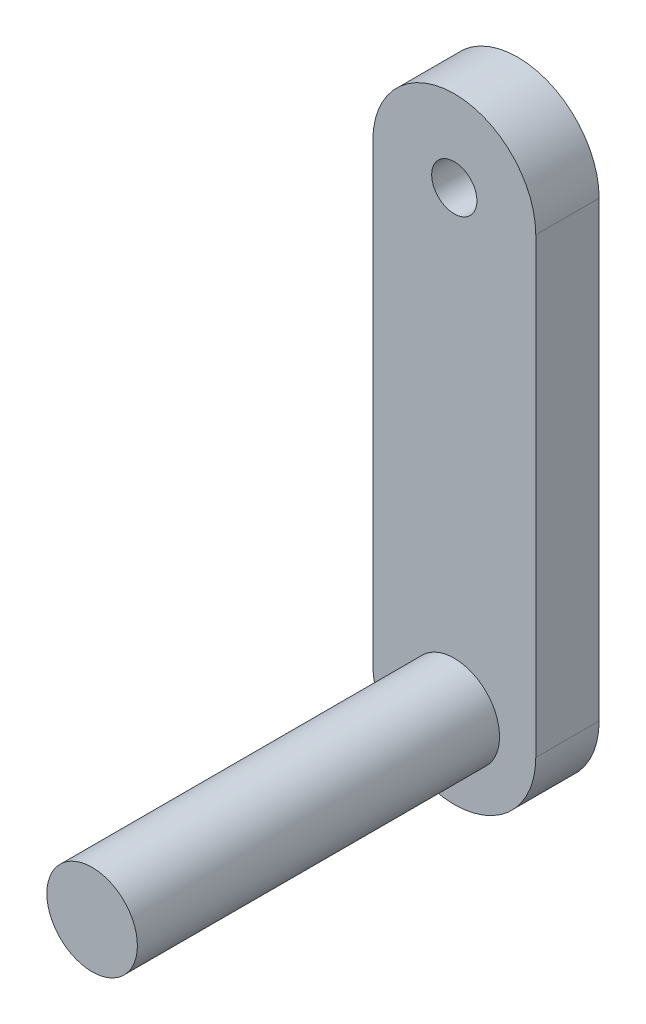
ISO-10303-21;
HEADER;
FILE_DESCRIPTION(('STEP AP214'),'2;1');
FILE_NAME('part.step','',(''),(''),'','','');
FILE_SCHEMA(('AUTOMOTIVE_DESIGN { 1 0 10303 214 1 1 1 1 }'));
ENDSEC;
DATA;
#1=APPLICATION_CONTEXT('core data for automotive mechanical design processes');
#2=APPLICATION_PROTOCOL_DEFINITION('international standard','automotive_design',2000,#1);
#3=PRODUCT_CONTEXT('',#1,'mechanical');
#4=PRODUCT('Part','Part','',(#3));
#5=PRODUCT_RELATED_PRODUCT_CATEGORY('part','',(#4));
#6=PRODUCT_DEFINITION_FORMATION('','',#4);
#7=PRODUCT_DEFINITION_CONTEXT('part definition',#1,'design');
#8=PRODUCT_DEFINITION('design','',#6,#7);
#9=PRODUCT_DEFINITION_SHAPE('','',#8);
#10=(LENGTH_UNIT() NAMED_UNIT(*) SI_UNIT(.MILLI.,.METRE.));
#11=(NAMED_UNIT(*) PLANE_ANGLE_UNIT() SI_UNIT($,.RADIAN.));
#12=(NAMED_UNIT(*) SI_UNIT($,.STERADIAN.) SOLID_ANGLE_UNIT());
#13=UNCERTAINTY_MEASURE_WITH_UNIT(LENGTH_MEASURE(1.E-05),#10,'distance_accuracy_value','');
#14=(GEOMETRIC_REPRESENTATION_CONTEXT(3) GLOBAL_UNCERTAINTY_ASSIGNED_CONTEXT((#13)) GLOBAL_UNIT_ASSIGNED_CONTEXT((#10,
#11,#12)) REPRESENTATION_CONTEXT('',''));
#15=CARTESIAN_POINT('',(0.,0.,0.));
#16=DIRECTION('',(0.,0.,1.));
#17=DIRECTION('',(1.,0.,0.));
#18=AXIS2_PLACEMENT_3D('',#15,#16,#17);
#19=CARTESIAN_POINT('',(0.,50.,7.));
#20=DIRECTION('',(0.,0.,-1.));
#21=DIRECTION('',(-1.,0.,0.));
#22=AXIS2_PLACEMENT_3D('',#19,#20,#21);
#23=PLANE('',#22);
#24=CARTESIAN_POINT('',(0.,50.,7.));
#25=DIRECTION('',(0.,0.,-1.));
#26=DIRECTION('',(-1.,0.,0.));
#27=AXIS2_PLACEMENT_3D('',#24,#25,#26);
#28=CIRCLE('',#27,2.49999999999999);
#29=CARTESIAN_POINT('',(-2.49999999999999,50.,7.));
#30=VERTEX_POINT('',#29);
#31=EDGE_CURVE('E148',#30,#30,#28,.T.);
#32=ORIENTED_EDGE('',*,*,#31,.T.);
#33=EDGE_LOOP('',(#32));
#34=FACE_BOUND('',#33,.T.);
#35=CARTESIAN_POINT('',(0.,50.,7.));
#36=DIRECTION('',(0.,0.,1.));
#37=DIRECTION('',(-1.,0.,0.));
#38=AXIS2_PLACEMENT_3D('',#35,#36,#37);
#39=CIRCLE('',#38,9.);
#40=CARTESIAN_POINT('',(9.,50.,7.));
#41=VERTEX_POINT('',#40);
#42=CARTESIAN_POINT('',(-9.,50.,7.));
#43=VERTEX_POINT('',#42);
#44=EDGE_CURVE('E88',#41,#43,#39,.T.);
#45=ORIENTED_EDGE('',*,*,#44,.T.);
#46=DIRECTION('',(0.,-1.,0.));
#47=VECTOR('',#46,1.);
#48=CARTESIAN_POINT('',(-9.,50.,7.));
#49=LINE('',#48,#47);
#50=CARTESIAN_POINT('',(-9.,0.,7.));
#51=VERTEX_POINT('',#50);
#52=EDGE_CURVE('E83',#43,#51,#49,.T.);
#53=ORIENTED_EDGE('',*,*,#52,.T.);
#54=CARTESIAN_POINT('',(0.,0.,7.));
#55=DIRECTION('',(0.,0.,1.));
#56=DIRECTION('',(1.,0.,0.));
#57=AXIS2_PLACEMENT_3D('',#54,#55,#56);
#58=CIRCLE('',#57,9.);
#59=CARTESIAN_POINT('',(9.,0.,7.));
#60=VERTEX_POINT('',#59);
#61=EDGE_CURVE('E86',#51,#60,#58,.T.);
#62=ORIENTED_EDGE('',*,*,#61,.T.);
#63=DIRECTION('',(0.,1.,0.));
#64=VECTOR('',#63,1.);
#65=CARTESIAN_POINT('',(9.,50.,7.));
#66=LINE('',#65,#64);
#67=EDGE_CURVE('E52',#60,#41,#66,.T.);
#68=ORIENTED_EDGE('',*,*,#67,.T.);
#69=EDGE_LOOP('',(#45,#53,#62,#68));
#70=FACE_BOUND('',#69,.T.);
#71=CARTESIAN_POINT('',(0.,0.,7.));
#72=DIRECTION('',(0.,0.,-1.));
#73=DIRECTION('',(-1.,0.,0.));
#74=AXIS2_PLACEMENT_3D('',#71,#72,#73);
#75=CIRCLE('',#74,5.);
#76=CARTESIAN_POINT('',(-5.,0.,7.));
#77=VERTEX_POINT('',#76);
#78=EDGE_CURVE('E11',#77,#77,#75,.F.);
#79=ORIENTED_EDGE('',*,*,#78,.F.);
#80=EDGE_LOOP('',(#79));
#81=FACE_BOUND('',#80,.T.);
#82=ADVANCED_FACE('F35',(#34,#70,#81),#23,.F.);
#83=CARTESIAN_POINT('',(0.,50.,7.));
#84=DIRECTION('',(0.,0.,-1.));
#85=DIRECTION('',(-1.,0.,0.));
#86=AXIS2_PLACEMENT_3D('',#83,#84,#85);
#87=CYLINDRICAL_SURFACE('',#86,9.);
#88=CARTESIAN_POINT('',(0.,50.,0.));
#89=DIRECTION('',(0.,0.,1.));
#90=DIRECTION('',(-1.,0.,0.));
#91=AXIS2_PLACEMENT_3D('',#88,#89,#90);
#92=CIRCLE('',#91,9.);
#93=CARTESIAN_POINT('',(9.,50.,0.));
#94=VERTEX_POINT('',#93);
#95=CARTESIAN_POINT('',(-9.,50.,0.));
#96=VERTEX_POINT('',#95);
#97=EDGE_CURVE('E102',#94,#96,#92,.T.);
#98=ORIENTED_EDGE('',*,*,#97,.T.);
#99=DIRECTION('',(0.,0.,-1.));
#100=VECTOR('',#99,1.);
#101=CARTESIAN_POINT('',(-9.,50.,7.));
#102=LINE('',#101,#100);
#103=EDGE_CURVE('E44',#43,#96,#102,.T.);
#104=ORIENTED_EDGE('',*,*,#103,.F.);
#105=ORIENTED_EDGE('',*,*,#44,.F.);
#106=DIRECTION('',(0.,0.,-1.));
#107=VECTOR('',#106,1.);
#108=CARTESIAN_POINT('',(9.,50.,7.));
#109=LINE('',#108,#107);
#110=EDGE_CURVE('E98',#41,#94,#109,.T.);
#111=ORIENTED_EDGE('',*,*,#110,.T.);
#112=EDGE_LOOP('',(#98,#104,#105,#111));
#113=FACE_BOUND('',#112,.T.);
#114=ADVANCED_FACE('F37',(#113),#87,.T.);
#115=CARTESIAN_POINT('',(-9.,50.,7.));
#116=DIRECTION('',(1.,0.,0.));
#117=DIRECTION('',(0.,1.,0.));
#118=AXIS2_PLACEMENT_3D('',#115,#116,#117);
#119=PLANE('',#118);
#120=DIRECTION('',(0.,-1.,0.));
#121=VECTOR('',#120,1.);
#122=CARTESIAN_POINT('',(-9.,50.,0.));
#123=LINE('',#122,#121);
#124=CARTESIAN_POINT('',(-9.,0.,0.));
#125=VERTEX_POINT('',#124);
#126=EDGE_CURVE('E93',#96,#125,#123,.T.);
#127=ORIENTED_EDGE('',*,*,#126,.T.);
#128=DIRECTION('',(0.,0.,-1.));
#129=VECTOR('',#128,1.);
#130=CARTESIAN_POINT('',(-9.,0.,7.));
#131=LINE('',#130,#129);
#132=EDGE_CURVE('E91',#51,#125,#131,.T.);
#133=ORIENTED_EDGE('',*,*,#132,.F.);
#134=ORIENTED_EDGE('',*,*,#52,.F.);
#135=ORIENTED_EDGE('',*,*,#103,.T.);
#136=EDGE_LOOP('',(#127,#133,#134,#135));
#137=FACE_BOUND('',#136,.T.);
#138=ADVANCED_FACE('F92',(#137),#119,.F.);
#139=CARTESIAN_POINT('',(0.,0.,7.));
#140=DIRECTION('',(0.,0.,-1.));
#141=DIRECTION('',(-1.,0.,0.));
#142=AXIS2_PLACEMENT_3D('',#139,#140,#141);
#143=CYLINDRICAL_SURFACE('',#142,9.);
#144=CARTESIAN_POINT('',(0.,0.,0.));
#145=DIRECTION('',(0.,0.,1.));
#146=DIRECTION('',(1.,0.,0.));
#147=AXIS2_PLACEMENT_3D('',#144,#145,#146);
#148=CIRCLE('',#147,9.);
#149=CARTESIAN_POINT('',(9.,0.,0.));
#150=VERTEX_POINT('',#149);
#151=EDGE_CURVE('E69',#125,#150,#148,.T.);
#152=ORIENTED_EDGE('',*,*,#151,.T.);
#153=DIRECTION('',(0.,0.,-1.));
#154=VECTOR('',#153,1.);
#155=CARTESIAN_POINT('',(9.,0.,7.));
#156=LINE('',#155,#154);
#157=EDGE_CURVE('E94',#60,#150,#156,.T.);
#158=ORIENTED_EDGE('',*,*,#157,.F.);
#159=ORIENTED_EDGE('',*,*,#61,.F.);
#160=ORIENTED_EDGE('',*,*,#132,.T.);
#161=EDGE_LOOP('',(#152,#158,#159,#160));
#162=FACE_BOUND('',#161,.T.);
#163=ADVANCED_FACE('F96',(#162),#143,.T.);
#164=CARTESIAN_POINT('',(9.,50.,7.));
#165=DIRECTION('',(-1.,0.,0.));
#166=DIRECTION('',(0.,0.,1.));
#167=AXIS2_PLACEMENT_3D('',#164,#165,#166);
#168=PLANE('',#167);
#169=DIRECTION('',(0.,1.,0.));
#170=VECTOR('',#169,1.);
#171=CARTESIAN_POINT('',(9.,50.,0.));
#172=LINE('',#171,#170);
#173=EDGE_CURVE('E75',#150,#94,#172,.T.);
#174=ORIENTED_EDGE('',*,*,#173,.T.);
#175=ORIENTED_EDGE('',*,*,#110,.F.);
#176=ORIENTED_EDGE('',*,*,#67,.F.);
#177=ORIENTED_EDGE('',*,*,#157,.T.);
#178=EDGE_LOOP('',(#174,#175,#176,#177));
#179=FACE_BOUND('',#178,.T.);
#180=ADVANCED_FACE('F116',(#179),#168,.F.);
#181=CARTESIAN_POINT('',(0.,50.,0.));
#182=DIRECTION('',(0.,0.,-1.));
#183=DIRECTION('',(-1.,0.,0.));
#184=AXIS2_PLACEMENT_3D('',#181,#182,#183);
#185=PLANE('',#184);
#186=CARTESIAN_POINT('',(0.,50.,0.));
#187=DIRECTION('',(0.,0.,-1.));
#188=DIRECTION('',(-1.,0.,0.));
#189=AXIS2_PLACEMENT_3D('',#186,#187,#188);
#190=CIRCLE('',#189,2.49999999999999);
#191=CARTESIAN_POINT('',(-2.49999999999999,50.,0.));
#192=VERTEX_POINT('',#191);
#193=EDGE_CURVE('E146',#192,#192,#190,.T.);
#194=ORIENTED_EDGE('',*,*,#193,.F.);
#195=EDGE_LOOP('',(#194));
#196=FACE_BOUND('',#195,.T.);
#197=ORIENTED_EDGE('',*,*,#97,.F.);
#198=ORIENTED_EDGE('',*,*,#173,.F.);
#199=ORIENTED_EDGE('',*,*,#151,.F.);
#200=ORIENTED_EDGE('',*,*,#126,.F.);
#201=EDGE_LOOP('',(#197,#198,#199,#200));
#202=FACE_BOUND('',#201,.T.);
#203=ADVANCED_FACE('F113',(#196,#202),#185,.T.);
#204=CARTESIAN_POINT('',(0.,0.,47.));
#205=DIRECTION('',(0.,0.,-1.));
#206=DIRECTION('',(-1.,0.,0.));
#207=AXIS2_PLACEMENT_3D('',#204,#205,#206);
#208=CYLINDRICAL_SURFACE('',#207,5.);
#209=CARTESIAN_POINT('',(0.,0.,47.));
#210=DIRECTION('',(0.,0.,1.));
#211=DIRECTION('',(1.,0.,0.));
#212=AXIS2_PLACEMENT_3D('',#209,#210,#211);
#213=CIRCLE('',#212,5.);
#214=CARTESIAN_POINT('',(5.,0.,47.));
#215=VERTEX_POINT('',#214);
#216=EDGE_CURVE('E105',#215,#215,#213,.T.);
#217=ORIENTED_EDGE('',*,*,#216,.F.);
#218=EDGE_LOOP('',(#217));
#219=FACE_BOUND('',#218,.T.);
#220=ORIENTED_EDGE('',*,*,#78,.T.);
#221=EDGE_LOOP('',(#220));
#222=FACE_BOUND('',#221,.T.);
#223=ADVANCED_FACE('F115',(#219,#222),#208,.T.);
#224=CARTESIAN_POINT('',(0.,0.,47.));
#225=DIRECTION('',(0.,0.,1.));
#226=DIRECTION('',(1.,0.,0.));
#227=AXIS2_PLACEMENT_3D('',#224,#225,#226);
#228=PLANE('',#227);
#229=ORIENTED_EDGE('',*,*,#216,.T.);
#230=EDGE_LOOP('',(#229));
#231=FACE_BOUND('',#230,.T.);
#232=ADVANCED_FACE('F123',(#231),#228,.T.);
#233=CARTESIAN_POINT('',(0.,50.,0.));
#234=DIRECTION('',(0.,0.,-1.));
#235=DIRECTION('',(-1.,0.,0.));
#236=AXIS2_PLACEMENT_3D('',#233,#234,#235);
#237=CYLINDRICAL_SURFACE('',#236,2.49999999999999);
#238=ORIENTED_EDGE('',*,*,#193,.T.);
#239=EDGE_LOOP('',(#238));
#240=FACE_BOUND('',#239,.T.);
#241=ORIENTED_EDGE('',*,*,#31,.F.);
#242=EDGE_LOOP('',(#241));
#243=FACE_BOUND('',#242,.T.);
#244=ADVANCED_FACE('F138',(#240,#243),#237,.F.);
#245=CLOSED_SHELL('',(#82,#114,#138,#163,#180,#203,#223,#232,#244));
#246=MANIFOLD_SOLID_BREP('B2',#245);
#247=ADVANCED_BREP_SHAPE_REPRESENTATION('',(#18,#246),#14);
#248=SHAPE_DEFINITION_REPRESENTATION(#9,#247);
ENDSEC;
END-ISO-10303-21;
